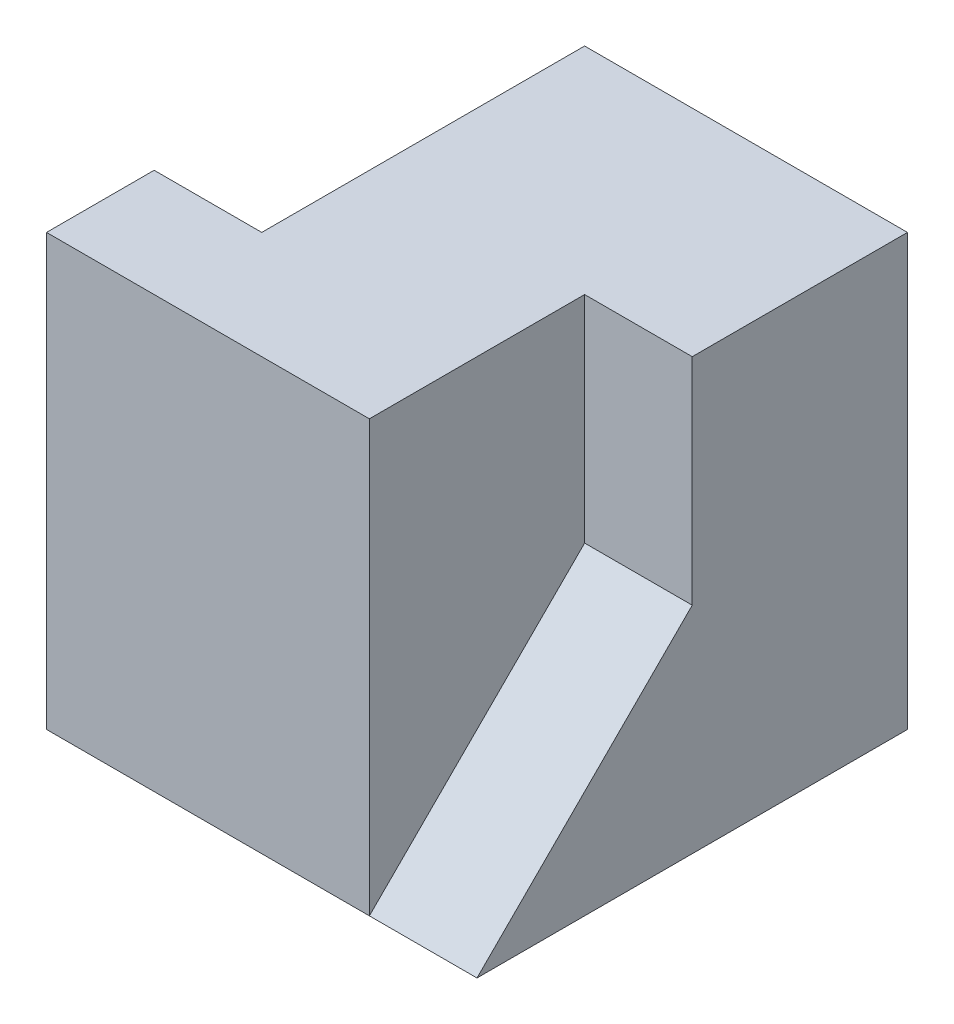
ISO-10303-21;
HEADER;
FILE_DESCRIPTION(('STEP AP214'),'2;1');
FILE_NAME('part.step','',(''),(''),'','','');
FILE_SCHEMA(('AUTOMOTIVE_DESIGN { 1 0 10303 214 1 1 1 1 }'));
ENDSEC;
DATA;
#1=APPLICATION_CONTEXT('core data for automotive mechanical design processes');
#2=APPLICATION_PROTOCOL_DEFINITION('international standard','automotive_design',2000,#1);
#3=PRODUCT_CONTEXT('',#1,'mechanical');
#4=PRODUCT('Part','Part','',(#3));
#5=PRODUCT_RELATED_PRODUCT_CATEGORY('part','',(#4));
#6=PRODUCT_DEFINITION_FORMATION('','',#4);
#7=PRODUCT_DEFINITION_CONTEXT('part definition',#1,'design');
#8=PRODUCT_DEFINITION('design','',#6,#7);
#9=PRODUCT_DEFINITION_SHAPE('','',#8);
#10=(LENGTH_UNIT() NAMED_UNIT(*) SI_UNIT(.MILLI.,.METRE.));
#11=(NAMED_UNIT(*) PLANE_ANGLE_UNIT() SI_UNIT($,.RADIAN.));
#12=(NAMED_UNIT(*) SI_UNIT($,.STERADIAN.) SOLID_ANGLE_UNIT());
#13=UNCERTAINTY_MEASURE_WITH_UNIT(LENGTH_MEASURE(1.E-05),#10,'distance_accuracy_value','');
#14=(GEOMETRIC_REPRESENTATION_CONTEXT(3) GLOBAL_UNCERTAINTY_ASSIGNED_CONTEXT((#13)) GLOBAL_UNIT_ASSIGNED_CONTEXT((#10,
#11,#12)) REPRESENTATION_CONTEXT('',''));
#15=CARTESIAN_POINT('',(0.,0.,0.));
#16=DIRECTION('',(0.,0.,1.));
#17=DIRECTION('',(1.,0.,0.));
#18=AXIS2_PLACEMENT_3D('',#15,#16,#17);
#19=CARTESIAN_POINT('',(10.,0.,0.));
#20=DIRECTION('',(1.,0.,0.));
#21=DIRECTION('',(0.,0.,-1.));
#22=AXIS2_PLACEMENT_3D('',#19,#20,#21);
#23=PLANE('',#22);
#24=DIRECTION('',(0.,0.894427190999916,0.447213595499958));
#25=VECTOR('',#24,1.);
#26=CARTESIAN_POINT('',(10.,-4.,8.));
#27=LINE('',#26,#25);
#28=CARTESIAN_POINT('',(10.,0.,10.));
#29=VERTEX_POINT('',#28);
#30=CARTESIAN_POINT('',(10.,40.,30.));
#31=VERTEX_POINT('',#30);
#32=EDGE_CURVE('E123',#29,#31,#27,.T.);
#33=ORIENTED_EDGE('',*,*,#32,.T.);
#34=DIRECTION('',(0.,0.,-1.));
#35=VECTOR('',#34,1.);
#36=CARTESIAN_POINT('',(10.,40.,0.));
#37=LINE('',#36,#35);
#38=CARTESIAN_POINT('',(10.,40.,0.));
#39=VERTEX_POINT('',#38);
#40=EDGE_CURVE('E77',#31,#39,#37,.T.);
#41=ORIENTED_EDGE('',*,*,#40,.T.);
#42=DIRECTION('',(0.,1.,0.));
#43=VECTOR('',#42,1.);
#44=CARTESIAN_POINT('',(10.,0.,0.));
#45=LINE('',#44,#43);
#46=CARTESIAN_POINT('',(10.,0.,0.));
#47=VERTEX_POINT('',#46);
#48=EDGE_CURVE('E135',#47,#39,#45,.T.);
#49=ORIENTED_EDGE('',*,*,#48,.F.);
#50=DIRECTION('',(0.,0.,-1.));
#51=VECTOR('',#50,1.);
#52=CARTESIAN_POINT('',(10.,0.,0.));
#53=LINE('',#52,#51);
#54=EDGE_CURVE('E134',#29,#47,#53,.T.);
#55=ORIENTED_EDGE('',*,*,#54,.F.);
#56=EDGE_LOOP('',(#33,#41,#49,#55));
#57=FACE_BOUND('',#56,.T.);
#58=ADVANCED_FACE('F54',(#57),#23,.F.);
#59=CARTESIAN_POINT('',(0.,0.,40.));
#60=DIRECTION('',(0.,0.,-1.));
#61=DIRECTION('',(-1.,0.,0.));
#62=AXIS2_PLACEMENT_3D('',#59,#60,#61);
#63=PLANE('',#62);
#64=DIRECTION('',(1.,0.,0.));
#65=VECTOR('',#64,1.);
#66=CARTESIAN_POINT('',(0.,0.,40.));
#67=LINE('',#66,#65);
#68=CARTESIAN_POINT('',(0.,0.,40.));
#69=VERTEX_POINT('',#68);
#70=CARTESIAN_POINT('',(30.,0.,40.));
#71=VERTEX_POINT('',#70);
#72=EDGE_CURVE('E152',#69,#71,#67,.T.);
#73=ORIENTED_EDGE('',*,*,#72,.T.);
#74=DIRECTION('',(0.,-1.,0.));
#75=VECTOR('',#74,1.);
#76=CARTESIAN_POINT('',(30.,0.,40.));
#77=LINE('',#76,#75);
#78=CARTESIAN_POINT('',(30.,40.,40.));
#79=VERTEX_POINT('',#78);
#80=EDGE_CURVE('E192',#79,#71,#77,.T.);
#81=ORIENTED_EDGE('',*,*,#80,.F.);
#82=DIRECTION('',(-1.,0.,0.));
#83=VECTOR('',#82,1.);
#84=CARTESIAN_POINT('',(0.,40.,40.));
#85=LINE('',#84,#83);
#86=CARTESIAN_POINT('',(0.,40.,40.));
#87=VERTEX_POINT('',#86);
#88=EDGE_CURVE('E155',#79,#87,#85,.T.);
#89=ORIENTED_EDGE('',*,*,#88,.T.);
#90=DIRECTION('',(0.,-1.,0.));
#91=VECTOR('',#90,1.);
#92=CARTESIAN_POINT('',(0.,0.,40.));
#93=LINE('',#92,#91);
#94=EDGE_CURVE('E149',#87,#69,#93,.T.);
#95=ORIENTED_EDGE('',*,*,#94,.T.);
#96=EDGE_LOOP('',(#73,#81,#89,#95));
#97=FACE_BOUND('',#96,.T.);
#98=ADVANCED_FACE('F211',(#97),#63,.F.);
#99=CARTESIAN_POINT('',(30.,0.,20.));
#100=DIRECTION('',(-1.,0.,0.));
#101=DIRECTION('',(0.,-1.,0.));
#102=AXIS2_PLACEMENT_3D('',#99,#100,#101);
#103=PLANE('',#102);
#104=ORIENTED_EDGE('',*,*,#80,.T.);
#105=DIRECTION('',(0.,0.707106781186548,-0.707106781186548));
#106=VECTOR('',#105,1.);
#107=CARTESIAN_POINT('',(30.,20.,20.));
#108=LINE('',#107,#106);
#109=CARTESIAN_POINT('',(30.,20.,20.));
#110=VERTEX_POINT('',#109);
#111=EDGE_CURVE('E198',#71,#110,#108,.T.);
#112=ORIENTED_EDGE('',*,*,#111,.T.);
#113=DIRECTION('',(0.,-1.,0.));
#114=VECTOR('',#113,1.);
#115=CARTESIAN_POINT('',(30.,0.,20.));
#116=LINE('',#115,#114);
#117=CARTESIAN_POINT('',(30.,40.,20.));
#118=VERTEX_POINT('',#117);
#119=EDGE_CURVE('E189',#118,#110,#116,.T.);
#120=ORIENTED_EDGE('',*,*,#119,.F.);
#121=DIRECTION('',(0.,0.,1.));
#122=VECTOR('',#121,1.);
#123=CARTESIAN_POINT('',(30.,40.,20.));
#124=LINE('',#123,#122);
#125=EDGE_CURVE('E69',#118,#79,#124,.T.);
#126=ORIENTED_EDGE('',*,*,#125,.T.);
#127=EDGE_LOOP('',(#104,#112,#120,#126));
#128=FACE_BOUND('',#127,.T.);
#129=ADVANCED_FACE('F203',(#128),#103,.F.);
#130=CARTESIAN_POINT('',(40.,0.,40.));
#131=DIRECTION('',(-1.,0.,0.));
#132=DIRECTION('',(0.,0.,1.));
#133=AXIS2_PLACEMENT_3D('',#130,#131,#132);
#134=PLANE('',#133);
#135=DIRECTION('',(0.,1.,0.));
#136=VECTOR('',#135,1.);
#137=CARTESIAN_POINT('',(40.,0.,20.));
#138=LINE('',#137,#136);
#139=CARTESIAN_POINT('',(40.,20.,20.));
#140=VERTEX_POINT('',#139);
#141=CARTESIAN_POINT('',(40.,40.,20.));
#142=VERTEX_POINT('',#141);
#143=EDGE_CURVE('E184',#140,#142,#138,.T.);
#144=ORIENTED_EDGE('',*,*,#143,.F.);
#145=DIRECTION('',(0.,0.707106781186548,-0.707106781186548));
#146=VECTOR('',#145,1.);
#147=CARTESIAN_POINT('',(40.,20.,20.));
#148=LINE('',#147,#146);
#149=CARTESIAN_POINT('',(40.,0.,40.));
#150=VERTEX_POINT('',#149);
#151=EDGE_CURVE('E130',#150,#140,#148,.T.);
#152=ORIENTED_EDGE('',*,*,#151,.F.);
#153=DIRECTION('',(0.,0.,-1.));
#154=VECTOR('',#153,1.);
#155=CARTESIAN_POINT('',(40.,0.,40.));
#156=LINE('',#155,#154);
#157=CARTESIAN_POINT('',(40.,0.,0.));
#158=VERTEX_POINT('',#157);
#159=EDGE_CURVE('E62',#150,#158,#156,.T.);
#160=ORIENTED_EDGE('',*,*,#159,.T.);
#161=DIRECTION('',(0.,1.,0.));
#162=VECTOR('',#161,1.);
#163=CARTESIAN_POINT('',(40.,0.,0.));
#164=LINE('',#163,#162);
#165=CARTESIAN_POINT('',(40.,40.,0.));
#166=VERTEX_POINT('',#165);
#167=EDGE_CURVE('E159',#158,#166,#164,.T.);
#168=ORIENTED_EDGE('',*,*,#167,.T.);
#169=DIRECTION('',(0.,0.,-1.));
#170=VECTOR('',#169,1.);
#171=CARTESIAN_POINT('',(40.,40.,40.));
#172=LINE('',#171,#170);
#173=EDGE_CURVE('E166',#142,#166,#172,.T.);
#174=ORIENTED_EDGE('',*,*,#173,.F.);
#175=EDGE_LOOP('',(#144,#152,#160,#168,#174));
#176=FACE_BOUND('',#175,.T.);
#177=ADVANCED_FACE('F171',(#176),#134,.F.);
#178=CARTESIAN_POINT('',(0.,0.,40.));
#179=DIRECTION('',(1.,0.,0.));
#180=DIRECTION('',(0.,0.,-1.));
#181=AXIS2_PLACEMENT_3D('',#178,#179,#180);
#182=PLANE('',#181);
#183=DIRECTION('',(0.,0.894427190999916,0.447213595499958));
#184=VECTOR('',#183,1.);
#185=CARTESIAN_POINT('',(0.,-4.,8.));
#186=LINE('',#185,#184);
#187=CARTESIAN_POINT('',(0.,0.,10.));
#188=VERTEX_POINT('',#187);
#189=CARTESIAN_POINT('',(0.,40.,30.));
#190=VERTEX_POINT('',#189);
#191=EDGE_CURVE('E131',#188,#190,#186,.T.);
#192=ORIENTED_EDGE('',*,*,#191,.F.);
#193=DIRECTION('',(0.,0.,-1.));
#194=VECTOR('',#193,1.);
#195=CARTESIAN_POINT('',(0.,0.,40.));
#196=LINE('',#195,#194);
#197=EDGE_CURVE('E12',#69,#188,#196,.T.);
#198=ORIENTED_EDGE('',*,*,#197,.F.);
#199=ORIENTED_EDGE('',*,*,#94,.F.);
#200=DIRECTION('',(0.,0.,-1.));
#201=VECTOR('',#200,1.);
#202=CARTESIAN_POINT('',(0.,40.,40.));
#203=LINE('',#202,#201);
#204=EDGE_CURVE('E157',#87,#190,#203,.T.);
#205=ORIENTED_EDGE('',*,*,#204,.T.);
#206=EDGE_LOOP('',(#192,#198,#199,#205));
#207=FACE_BOUND('',#206,.T.);
#208=ADVANCED_FACE('F56',(#207),#182,.F.);
#209=CARTESIAN_POINT('',(0.,0.,40.));
#210=DIRECTION('',(0.,1.,0.));
#211=DIRECTION('',(0.,0.,1.));
#212=AXIS2_PLACEMENT_3D('',#209,#210,#211);
#213=PLANE('',#212);
#214=DIRECTION('',(1.,0.,0.));
#215=VECTOR('',#214,1.);
#216=CARTESIAN_POINT('',(0.,0.,10.));
#217=LINE('',#216,#215);
#218=EDGE_CURVE('E127',#188,#29,#217,.T.);
#219=ORIENTED_EDGE('',*,*,#218,.T.);
#220=ORIENTED_EDGE('',*,*,#54,.T.);
#221=DIRECTION('',(1.,0.,0.));
#222=VECTOR('',#221,1.);
#223=CARTESIAN_POINT('',(0.,0.,0.));
#224=LINE('',#223,#222);
#225=EDGE_CURVE('E148',#47,#158,#224,.T.);
#226=ORIENTED_EDGE('',*,*,#225,.T.);
#227=ORIENTED_EDGE('',*,*,#159,.F.);
#228=DIRECTION('',(1.,0.,0.));
#229=VECTOR('',#228,1.);
#230=CARTESIAN_POINT('',(30.,0.,40.));
#231=LINE('',#230,#229);
#232=EDGE_CURVE('E196',#71,#150,#231,.T.);
#233=ORIENTED_EDGE('',*,*,#232,.F.);
#234=ORIENTED_EDGE('',*,*,#72,.F.);
#235=ORIENTED_EDGE('',*,*,#197,.T.);
#236=EDGE_LOOP('',(#219,#220,#226,#227,#233,#234,#235));
#237=FACE_BOUND('',#236,.T.);
#238=ADVANCED_FACE('F140',(#237),#213,.F.);
#239=CARTESIAN_POINT('',(0.,40.,40.));
#240=DIRECTION('',(0.,-1.,0.));
#241=DIRECTION('',(0.,0.,-1.));
#242=AXIS2_PLACEMENT_3D('',#239,#240,#241);
#243=PLANE('',#242);
#244=ORIENTED_EDGE('',*,*,#204,.F.);
#245=ORIENTED_EDGE('',*,*,#88,.F.);
#246=ORIENTED_EDGE('',*,*,#125,.F.);
#247=DIRECTION('',(-1.,0.,0.));
#248=VECTOR('',#247,1.);
#249=CARTESIAN_POINT('',(0.,40.,20.));
#250=LINE('',#249,#248);
#251=EDGE_CURVE('E183',#142,#118,#250,.T.);
#252=ORIENTED_EDGE('',*,*,#251,.F.);
#253=ORIENTED_EDGE('',*,*,#173,.T.);
#254=DIRECTION('',(-1.,0.,0.));
#255=VECTOR('',#254,1.);
#256=CARTESIAN_POINT('',(0.,40.,0.));
#257=LINE('',#256,#255);
#258=EDGE_CURVE('E153',#166,#39,#257,.T.);
#259=ORIENTED_EDGE('',*,*,#258,.T.);
#260=ORIENTED_EDGE('',*,*,#40,.F.);
#261=DIRECTION('',(1.,0.,0.));
#262=VECTOR('',#261,1.);
#263=CARTESIAN_POINT('',(0.,40.,30.));
#264=LINE('',#263,#262);
#265=EDGE_CURVE('E129',#190,#31,#264,.T.);
#266=ORIENTED_EDGE('',*,*,#265,.F.);
#267=EDGE_LOOP('',(#244,#245,#246,#252,#253,#259,#260,#266));
#268=FACE_BOUND('',#267,.T.);
#269=ADVANCED_FACE('F180',(#268),#243,.F.);
#270=CARTESIAN_POINT('',(0.,0.,0.));
#271=DIRECTION('',(0.,0.,-1.));
#272=DIRECTION('',(-1.,0.,0.));
#273=AXIS2_PLACEMENT_3D('',#270,#271,#272);
#274=PLANE('',#273);
#275=ORIENTED_EDGE('',*,*,#48,.T.);
#276=ORIENTED_EDGE('',*,*,#258,.F.);
#277=ORIENTED_EDGE('',*,*,#167,.F.);
#278=ORIENTED_EDGE('',*,*,#225,.F.);
#279=EDGE_LOOP('',(#275,#276,#277,#278));
#280=FACE_BOUND('',#279,.T.);
#281=ADVANCED_FACE('F177',(#280),#274,.T.);
#282=CARTESIAN_POINT('',(0.,0.,20.));
#283=DIRECTION('',(0.,0.,1.));
#284=DIRECTION('',(1.,0.,0.));
#285=AXIS2_PLACEMENT_3D('',#282,#283,#284);
#286=PLANE('',#285);
#287=ORIENTED_EDGE('',*,*,#251,.T.);
#288=ORIENTED_EDGE('',*,*,#119,.T.);
#289=DIRECTION('',(-1.,0.,0.));
#290=VECTOR('',#289,1.);
#291=CARTESIAN_POINT('',(0.,20.,20.));
#292=LINE('',#291,#290);
#293=EDGE_CURVE('E187',#140,#110,#292,.T.);
#294=ORIENTED_EDGE('',*,*,#293,.F.);
#295=ORIENTED_EDGE('',*,*,#143,.T.);
#296=EDGE_LOOP('',(#287,#288,#294,#295));
#297=FACE_BOUND('',#296,.T.);
#298=ADVANCED_FACE('F202',(#297),#286,.T.);
#299=CARTESIAN_POINT('',(30.,20.,20.));
#300=DIRECTION('',(0.,-0.707106781186548,-0.707106781186548));
#301=DIRECTION('',(0.,0.707106781186548,-0.707106781186548));
#302=AXIS2_PLACEMENT_3D('',#299,#300,#301);
#303=PLANE('',#302);
#304=ORIENTED_EDGE('',*,*,#151,.T.);
#305=ORIENTED_EDGE('',*,*,#293,.T.);
#306=ORIENTED_EDGE('',*,*,#111,.F.);
#307=ORIENTED_EDGE('',*,*,#232,.T.);
#308=EDGE_LOOP('',(#304,#305,#306,#307));
#309=FACE_BOUND('',#308,.T.);
#310=ADVANCED_FACE('F212',(#309),#303,.F.);
#311=CARTESIAN_POINT('',(10.,-4.,8.));
#312=DIRECTION('',(0.,-0.447213595499958,0.894427190999916));
#313=DIRECTION('',(0.,-0.894427190999916,-0.447213595499958));
#314=AXIS2_PLACEMENT_3D('',#311,#312,#313);
#315=PLANE('',#314);
#316=ORIENTED_EDGE('',*,*,#32,.F.);
#317=ORIENTED_EDGE('',*,*,#218,.F.);
#318=ORIENTED_EDGE('',*,*,#191,.T.);
#319=ORIENTED_EDGE('',*,*,#265,.T.);
#320=EDGE_LOOP('',(#316,#317,#318,#319));
#321=FACE_BOUND('',#320,.T.);
#322=ADVANCED_FACE('F125',(#321),#315,.F.);
#323=CLOSED_SHELL('',(#58,#98,#129,#177,#208,#238,#269,#281,#298,#310,#322));
#324=MANIFOLD_SOLID_BREP('B2',#323);
#325=ADVANCED_BREP_SHAPE_REPRESENTATION('',(#18,#324),#14);
#326=SHAPE_DEFINITION_REPRESENTATION(#9,#325);
ENDSEC;
END-ISO-10303-21;
